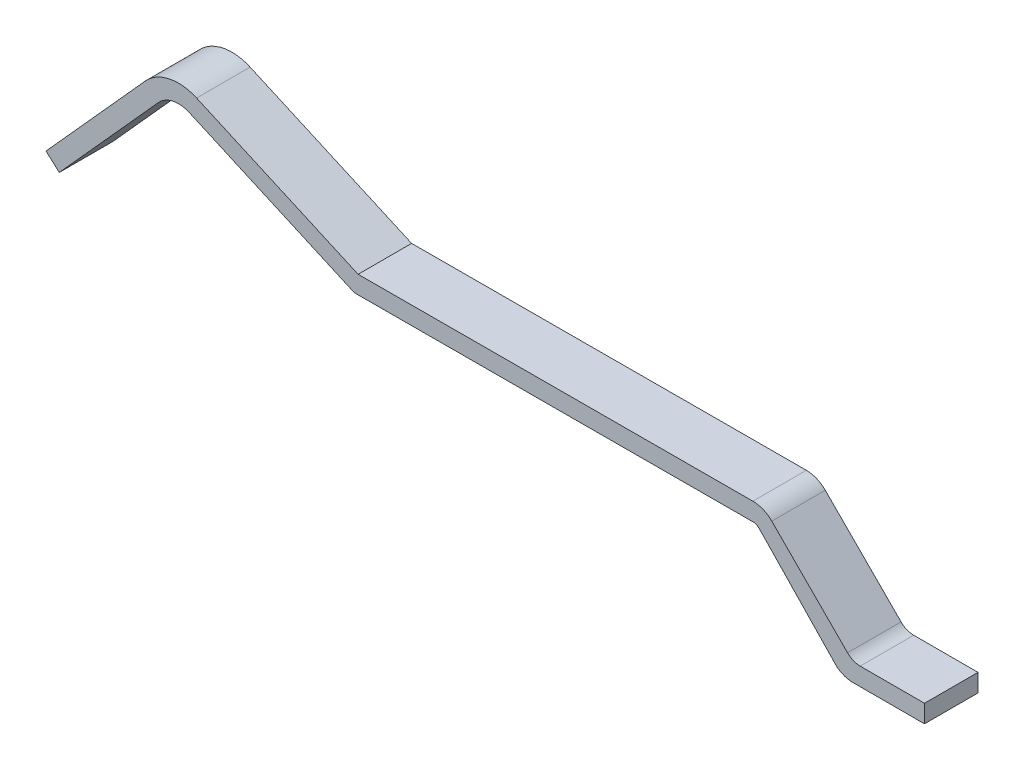
ISO-10303-21;
HEADER;
FILE_DESCRIPTION(('STEP AP214'),'2;1');
FILE_NAME('part.step','',(''),(''),'','','');
FILE_SCHEMA(('AUTOMOTIVE_DESIGN { 1 0 10303 214 1 1 1 1 }'));
ENDSEC;
DATA;
#1=APPLICATION_CONTEXT('core data for automotive mechanical design processes');
#2=APPLICATION_PROTOCOL_DEFINITION('international standard','automotive_design',2000,#1);
#3=PRODUCT_CONTEXT('',#1,'mechanical');
#4=PRODUCT('Part','Part','',(#3));
#5=PRODUCT_RELATED_PRODUCT_CATEGORY('part','',(#4));
#6=PRODUCT_DEFINITION_FORMATION('','',#4);
#7=PRODUCT_DEFINITION_CONTEXT('part definition',#1,'design');
#8=PRODUCT_DEFINITION('design','',#6,#7);
#9=PRODUCT_DEFINITION_SHAPE('','',#8);
#10=(LENGTH_UNIT() NAMED_UNIT(*) SI_UNIT(.MILLI.,.METRE.));
#11=(NAMED_UNIT(*) PLANE_ANGLE_UNIT() SI_UNIT($,.RADIAN.));
#12=(NAMED_UNIT(*) SI_UNIT($,.STERADIAN.) SOLID_ANGLE_UNIT());
#13=UNCERTAINTY_MEASURE_WITH_UNIT(LENGTH_MEASURE(1.E-05),#10,'distance_accuracy_value','');
#14=(GEOMETRIC_REPRESENTATION_CONTEXT(3) GLOBAL_UNCERTAINTY_ASSIGNED_CONTEXT((#13)) GLOBAL_UNIT_ASSIGNED_CONTEXT((#10,
#11,#12)) REPRESENTATION_CONTEXT('',''));
#15=CARTESIAN_POINT('',(0.,0.,0.));
#16=DIRECTION('',(0.,0.,1.));
#17=DIRECTION('',(1.,0.,0.));
#18=AXIS2_PLACEMENT_3D('',#15,#16,#17);
#19=CARTESIAN_POINT('',(18.078994901728,0.200000000000047,0.3));
#20=DIRECTION('',(0.,-1.,0.));
#21=DIRECTION('',(1.,0.,0.));
#22=AXIS2_PLACEMENT_3D('',#19,#20,#21);
#23=PLANE('',#22);
#24=DIRECTION('',(-1.,0.,0.));
#25=VECTOR('',#24,1.);
#26=CARTESIAN_POINT('',(18.078994901728,0.200000000000047,-0.3));
#27=LINE('',#26,#25);
#28=CARTESIAN_POINT('',(18.8,0.200000000000047,-0.3));
#29=VERTEX_POINT('',#28);
#30=CARTESIAN_POINT('',(18.078994901728,0.200000000000047,-0.3));
#31=VERTEX_POINT('',#30);
#32=EDGE_CURVE('E188',#29,#31,#27,.T.);
#33=ORIENTED_EDGE('',*,*,#32,.T.);
#34=DIRECTION('',(0.,0.,-1.));
#35=VECTOR('',#34,1.);
#36=CARTESIAN_POINT('',(18.078994901728,0.200000000000047,0.3));
#37=LINE('',#36,#35);
#38=CARTESIAN_POINT('',(18.078994901728,0.200000000000047,0.3));
#39=VERTEX_POINT('',#38);
#40=EDGE_CURVE('E11',#39,#31,#37,.T.);
#41=ORIENTED_EDGE('',*,*,#40,.F.);
#42=DIRECTION('',(-1.,0.,0.));
#43=VECTOR('',#42,1.);
#44=CARTESIAN_POINT('',(18.078994901728,0.200000000000047,0.3));
#45=LINE('',#44,#43);
#46=CARTESIAN_POINT('',(18.8,0.200000000000047,0.3));
#47=VERTEX_POINT('',#46);
#48=EDGE_CURVE('E222',#47,#39,#45,.T.);
#49=ORIENTED_EDGE('',*,*,#48,.F.);
#50=DIRECTION('',(0.,0.,-1.));
#51=VECTOR('',#50,1.);
#52=CARTESIAN_POINT('',(18.8,0.200000000000047,0.3));
#53=LINE('',#52,#51);
#54=EDGE_CURVE('E184',#47,#29,#53,.T.);
#55=ORIENTED_EDGE('',*,*,#54,.T.);
#56=EDGE_LOOP('',(#33,#41,#49,#55));
#57=FACE_BOUND('',#56,.T.);
#58=ADVANCED_FACE('F32',(#57),#23,.F.);
#59=CARTESIAN_POINT('',(18.078994901728,0.400000000000047,0.3));
#60=DIRECTION('',(0.,0.,-1.));
#61=DIRECTION('',(-1.,0.,0.));
#62=AXIS2_PLACEMENT_3D('',#59,#60,#61);
#63=CYLINDRICAL_SURFACE('',#62,0.2);
#64=CARTESIAN_POINT('',(18.078994901728,0.400000000000047,-0.3));
#65=DIRECTION('',(0.,0.,-1.));
#66=DIRECTION('',(1.,0.,0.));
#67=AXIS2_PLACEMENT_3D('',#64,#65,#66);
#68=CIRCLE('',#67,0.2);
#69=CARTESIAN_POINT('',(17.9372543641692,0.258898547092701,-0.3));
#70=VERTEX_POINT('',#69);
#71=EDGE_CURVE('E191',#31,#70,#68,.T.);
#72=ORIENTED_EDGE('',*,*,#71,.T.);
#73=DIRECTION('',(0.,0.,-1.));
#74=VECTOR('',#73,1.);
#75=CARTESIAN_POINT('',(17.9372543641692,0.258898547092701,0.3));
#76=LINE('',#75,#74);
#77=CARTESIAN_POINT('',(17.9372543641692,0.258898547092701,0.3));
#78=VERTEX_POINT('',#77);
#79=EDGE_CURVE('E40',#78,#70,#76,.T.);
#80=ORIENTED_EDGE('',*,*,#79,.F.);
#81=CARTESIAN_POINT('',(18.078994901728,0.400000000000047,0.3));
#82=DIRECTION('',(0.,0.,-1.));
#83=DIRECTION('',(1.,0.,0.));
#84=AXIS2_PLACEMENT_3D('',#81,#82,#83);
#85=CIRCLE('',#84,0.2);
#86=EDGE_CURVE('E121',#39,#78,#85,.T.);
#87=ORIENTED_EDGE('',*,*,#86,.F.);
#88=ORIENTED_EDGE('',*,*,#40,.T.);
#89=EDGE_LOOP('',(#72,#80,#87,#88));
#90=FACE_BOUND('',#89,.T.);
#91=ADVANCED_FACE('F330',(#90),#63,.F.);
#92=CARTESIAN_POINT('',(17.0878679656441,1.11213203435578,0.3));
#93=DIRECTION('',(-0.708702687793621,-0.705507264536729,0.));
#94=DIRECTION('',(0.705507264536729,-0.708702687793621,0.));
#95=AXIS2_PLACEMENT_3D('',#92,#93,#94);
#96=PLANE('',#95);
#97=DIRECTION('',(-0.705507264536729,0.708702687793621,0.));
#98=VECTOR('',#97,1.);
#99=CARTESIAN_POINT('',(17.0878679656441,1.11213203435578,-0.3));
#100=LINE('',#99,#98);
#101=CARTESIAN_POINT('',(17.0878679656441,1.11213203435578,-0.3));
#102=VERTEX_POINT('',#101);
#103=EDGE_CURVE('E193',#70,#102,#100,.T.);
#104=ORIENTED_EDGE('',*,*,#103,.T.);
#105=DIRECTION('',(0.,0.,-1.));
#106=VECTOR('',#105,1.);
#107=CARTESIAN_POINT('',(17.0878679656441,1.11213203435578,0.3));
#108=LINE('',#107,#106);
#109=CARTESIAN_POINT('',(17.0878679656441,1.11213203435578,0.3));
#110=VERTEX_POINT('',#109);
#111=EDGE_CURVE('E259',#110,#102,#108,.T.);
#112=ORIENTED_EDGE('',*,*,#111,.F.);
#113=DIRECTION('',(-0.705507264536729,0.708702687793621,0.));
#114=VECTOR('',#113,1.);
#115=CARTESIAN_POINT('',(17.0878679656441,1.11213203435578,0.3));
#116=LINE('',#115,#114);
#117=EDGE_CURVE('E267',#78,#110,#116,.T.);
#118=ORIENTED_EDGE('',*,*,#117,.F.);
#119=ORIENTED_EDGE('',*,*,#79,.T.);
#120=EDGE_LOOP('',(#104,#112,#118,#119));
#121=FACE_BOUND('',#120,.T.);
#122=ADVANCED_FACE('F265',(#121),#96,.F.);
#123=CARTESIAN_POINT('',(16.8764101070644,0.901627604302296,0.3));
#124=DIRECTION('',(0.,0.,-1.));
#125=DIRECTION('',(-1.,0.,0.));
#126=AXIS2_PLACEMENT_3D('',#123,#124,#125);
#127=CYLINDRICAL_SURFACE('',#126,0.298373157350417);
#128=CARTESIAN_POINT('',(16.8764101070644,0.901627604302296,-0.3));
#129=DIRECTION('',(0.,0.,1.));
#130=DIRECTION('',(1.,0.,0.));
#131=AXIS2_PLACEMENT_3D('',#128,#129,#130);
#132=CIRCLE('',#131,0.298373157350417);
#133=CARTESIAN_POINT('',(16.8757359312881,1.19999999999982,-0.3));
#134=VERTEX_POINT('',#133);
#135=EDGE_CURVE('E195',#102,#134,#132,.T.);
#136=ORIENTED_EDGE('',*,*,#135,.T.);
#137=DIRECTION('',(0.,0.,-1.));
#138=VECTOR('',#137,1.);
#139=CARTESIAN_POINT('',(16.8757359312881,1.19999999999982,0.3));
#140=LINE('',#139,#138);
#141=CARTESIAN_POINT('',(16.8757359312881,1.19999999999982,0.3));
#142=VERTEX_POINT('',#141);
#143=EDGE_CURVE('E256',#142,#134,#140,.T.);
#144=ORIENTED_EDGE('',*,*,#143,.F.);
#145=CARTESIAN_POINT('',(16.8764101070644,0.901627604302296,0.3));
#146=DIRECTION('',(0.,0.,1.));
#147=DIRECTION('',(1.,0.,0.));
#148=AXIS2_PLACEMENT_3D('',#145,#146,#147);
#149=CIRCLE('',#148,0.298373157350417);
#150=EDGE_CURVE('E285',#110,#142,#149,.T.);
#151=ORIENTED_EDGE('',*,*,#150,.F.);
#152=ORIENTED_EDGE('',*,*,#111,.T.);
#153=EDGE_LOOP('',(#136,#144,#151,#152));
#154=FACE_BOUND('',#153,.T.);
#155=ADVANCED_FACE('F276',(#154),#127,.T.);
#156=CARTESIAN_POINT('',(12.4499999999999,1.19000000000005,0.3));
#157=DIRECTION('',(0.00225950545359492,-0.999997447314295,0.));
#158=DIRECTION('',(0.999997447314295,0.00225950545359492,0.));
#159=AXIS2_PLACEMENT_3D('',#156,#157,#158);
#160=PLANE('',#159);
#161=DIRECTION('',(-0.999997447314295,-0.00225950545359492,0.));
#162=VECTOR('',#161,1.);
#163=CARTESIAN_POINT('',(12.4499999999999,1.19000000000005,-0.3));
#164=LINE('',#163,#162);
#165=CARTESIAN_POINT('',(12.4499999999999,1.19000000000005,-0.3));
#166=VERTEX_POINT('',#165);
#167=EDGE_CURVE('E197',#134,#166,#164,.T.);
#168=ORIENTED_EDGE('',*,*,#167,.T.);
#169=DIRECTION('',(0.,0.,-1.));
#170=VECTOR('',#169,1.);
#171=CARTESIAN_POINT('',(12.4499999999999,1.19000000000005,0.3));
#172=LINE('',#171,#170);
#173=CARTESIAN_POINT('',(12.4499999999999,1.19000000000005,0.3));
#174=VERTEX_POINT('',#173);
#175=EDGE_CURVE('E253',#174,#166,#172,.T.);
#176=ORIENTED_EDGE('',*,*,#175,.F.);
#177=DIRECTION('',(-0.999997447314295,-0.00225950545359492,0.));
#178=VECTOR('',#177,1.);
#179=CARTESIAN_POINT('',(12.4499999999999,1.19000000000005,0.3));
#180=LINE('',#179,#178);
#181=EDGE_CURVE('E282',#142,#174,#180,.T.);
#182=ORIENTED_EDGE('',*,*,#181,.F.);
#183=ORIENTED_EDGE('',*,*,#143,.T.);
#184=EDGE_LOOP('',(#168,#176,#182,#183));
#185=FACE_BOUND('',#184,.T.);
#186=ADVANCED_FACE('F280',(#185),#160,.F.);
#187=CARTESIAN_POINT('',(10.6393188810586,1.9961671740989,0.3));
#188=DIRECTION('',(-0.40673664307565,-0.913545457642668,0.));
#189=DIRECTION('',(0.913545457642668,-0.40673664307565,0.));
#190=AXIS2_PLACEMENT_3D('',#187,#188,#189);
#191=PLANE('',#190);
#192=DIRECTION('',(-0.913545457642668,0.40673664307565,0.));
#193=VECTOR('',#192,1.);
#194=CARTESIAN_POINT('',(10.6393188810586,1.9961671740989,-0.3));
#195=LINE('',#194,#193);
#196=CARTESIAN_POINT('',(10.6393188810586,1.9961671740989,-0.3));
#197=VERTEX_POINT('',#196);
#198=EDGE_CURVE('E199',#166,#197,#195,.T.);
#199=ORIENTED_EDGE('',*,*,#198,.T.);
#200=DIRECTION('',(0.,0.,-1.));
#201=VECTOR('',#200,1.);
#202=CARTESIAN_POINT('',(10.6393188810586,1.9961671740989,0.3));
#203=LINE('',#202,#201);
#204=CARTESIAN_POINT('',(10.6393188810586,1.9961671740989,0.3));
#205=VERTEX_POINT('',#204);
#206=EDGE_CURVE('E250',#205,#197,#203,.T.);
#207=ORIENTED_EDGE('',*,*,#206,.F.);
#208=DIRECTION('',(-0.913545457642668,0.40673664307565,0.));
#209=VECTOR('',#208,1.);
#210=CARTESIAN_POINT('',(10.6393188810586,1.9961671740989,0.3));
#211=LINE('',#210,#209);
#212=EDGE_CURVE('E284',#174,#205,#211,.T.);
#213=ORIENTED_EDGE('',*,*,#212,.F.);
#214=ORIENTED_EDGE('',*,*,#175,.T.);
#215=EDGE_LOOP('',(#199,#207,#213,#214));
#216=FACE_BOUND('',#215,.T.);
#217=ADVANCED_FACE('F343',(#216),#191,.F.);
#218=CARTESIAN_POINT('',(10.4359505595208,1.53939444527736,0.3));
#219=DIRECTION('',(0.,0.,-1.));
#220=DIRECTION('',(-1.,0.,0.));
#221=AXIS2_PLACEMENT_3D('',#218,#219,#220);
#222=CYLINDRICAL_SURFACE('',#221,0.50000000000019);
#223=CARTESIAN_POINT('',(10.4359505595208,1.53939444527736,-0.3));
#224=DIRECTION('',(0.,0.,1.));
#225=DIRECTION('',(1.,0.,0.));
#226=AXIS2_PLACEMENT_3D('',#223,#224,#225);
#227=CIRCLE('',#226,0.50000000000019);
#228=CARTESIAN_POINT('',(10.0643781467819,1.87395974845692,-0.3));
#229=VERTEX_POINT('',#228);
#230=EDGE_CURVE('E201',#197,#229,#227,.T.);
#231=ORIENTED_EDGE('',*,*,#230,.T.);
#232=DIRECTION('',(0.,0.,-1.));
#233=VECTOR('',#232,1.);
#234=CARTESIAN_POINT('',(10.0643781467819,1.87395974845692,0.3));
#235=LINE('',#234,#233);
#236=CARTESIAN_POINT('',(10.0643781467819,1.87395974845692,0.3));
#237=VERTEX_POINT('',#236);
#238=EDGE_CURVE('E247',#237,#229,#235,.T.);
#239=ORIENTED_EDGE('',*,*,#238,.F.);
#240=CARTESIAN_POINT('',(10.4359505595208,1.53939444527736,0.3));
#241=DIRECTION('',(0.,0.,1.));
#242=DIRECTION('',(1.,0.,0.));
#243=AXIS2_PLACEMENT_3D('',#240,#241,#242);
#244=CIRCLE('',#243,0.50000000000019);
#245=EDGE_CURVE('E287',#205,#237,#244,.T.);
#246=ORIENTED_EDGE('',*,*,#245,.F.);
#247=ORIENTED_EDGE('',*,*,#206,.T.);
#248=EDGE_LOOP('',(#231,#239,#246,#247));
#249=FACE_BOUND('',#248,.T.);
#250=ADVANCED_FACE('F346',(#249),#222,.T.);
#251=CARTESIAN_POINT('',(8.95090286046869,0.63732016052452,0.3));
#252=DIRECTION('',(0.743144825477361,-0.669130606358895,0.));
#253=DIRECTION('',(0.669130606358895,0.743144825477361,0.));
#254=AXIS2_PLACEMENT_3D('',#251,#252,#253);
#255=PLANE('',#254);
#256=DIRECTION('',(-0.669130606358895,-0.743144825477361,0.));
#257=VECTOR('',#256,1.);
#258=CARTESIAN_POINT('',(8.95090286046869,0.63732016052452,-0.3));
#259=LINE('',#258,#257);
#260=CARTESIAN_POINT('',(8.95090286046869,0.63732016052452,-0.3));
#261=VERTEX_POINT('',#260);
#262=EDGE_CURVE('E203',#229,#261,#259,.T.);
#263=ORIENTED_EDGE('',*,*,#262,.T.);
#264=DIRECTION('',(0.,0.,-1.));
#265=VECTOR('',#264,1.);
#266=CARTESIAN_POINT('',(8.95090286046869,0.63732016052452,0.3));
#267=LINE('',#266,#265);
#268=CARTESIAN_POINT('',(8.95090286046869,0.63732016052452,0.3));
#269=VERTEX_POINT('',#268);
#270=EDGE_CURVE('E244',#269,#261,#267,.T.);
#271=ORIENTED_EDGE('',*,*,#270,.F.);
#272=DIRECTION('',(-0.669130606358895,-0.743144825477361,0.));
#273=VECTOR('',#272,1.);
#274=CARTESIAN_POINT('',(8.95090286046869,0.63732016052452,0.3));
#275=LINE('',#274,#273);
#276=EDGE_CURVE('E293',#237,#269,#275,.T.);
#277=ORIENTED_EDGE('',*,*,#276,.F.);
#278=ORIENTED_EDGE('',*,*,#238,.T.);
#279=EDGE_LOOP('',(#263,#271,#277,#278));
#280=FACE_BOUND('',#279,.T.);
#281=ADVANCED_FACE('F350',(#280),#255,.F.);
#282=CARTESIAN_POINT('',(9.09953182556442,0.503494039252559,0.3));
#283=DIRECTION('',(0.669130606358746,0.743144825477495,0.));
#284=DIRECTION('',(-0.743144825477495,0.669130606358746,0.));
#285=AXIS2_PLACEMENT_3D('',#282,#283,#284);
#286=PLANE('',#285);
#287=DIRECTION('',(0.743144825477495,-0.669130606358746,0.));
#288=VECTOR('',#287,1.);
#289=CARTESIAN_POINT('',(9.09953182556442,0.503494039252559,-0.3));
#290=LINE('',#289,#288);
#291=CARTESIAN_POINT('',(9.09953182556442,0.503494039252559,-0.3));
#292=VERTEX_POINT('',#291);
#293=EDGE_CURVE('E205',#261,#292,#290,.T.);
#294=ORIENTED_EDGE('',*,*,#293,.T.);
#295=DIRECTION('',(0.,0.,-1.));
#296=VECTOR('',#295,1.);
#297=CARTESIAN_POINT('',(9.09953182556442,0.503494039252559,0.3));
#298=LINE('',#297,#296);
#299=CARTESIAN_POINT('',(9.09953182556442,0.503494039252559,0.3));
#300=VERTEX_POINT('',#299);
#301=EDGE_CURVE('E241',#300,#292,#298,.T.);
#302=ORIENTED_EDGE('',*,*,#301,.F.);
#303=DIRECTION('',(0.743144825477495,-0.669130606358746,0.));
#304=VECTOR('',#303,1.);
#305=CARTESIAN_POINT('',(9.09953182556442,0.503494039252559,0.3));
#306=LINE('',#305,#304);
#307=EDGE_CURVE('E295',#269,#300,#306,.T.);
#308=ORIENTED_EDGE('',*,*,#307,.F.);
#309=ORIENTED_EDGE('',*,*,#270,.T.);
#310=EDGE_LOOP('',(#294,#302,#308,#309));
#311=FACE_BOUND('',#310,.T.);
#312=ADVANCED_FACE('F354',(#311),#286,.F.);
#313=CARTESIAN_POINT('',(10.2130071118774,1.74013362718514,0.3));
#314=DIRECTION('',(-0.743144825477495,0.669130606358746,0.));
#315=DIRECTION('',(-0.669130606358746,-0.743144825477495,0.));
#316=AXIS2_PLACEMENT_3D('',#313,#314,#315);
#317=PLANE('',#316);
#318=DIRECTION('',(0.669130606358746,0.743144825477495,0.));
#319=VECTOR('',#318,1.);
#320=CARTESIAN_POINT('',(10.2130071118774,1.74013362718514,-0.3));
#321=LINE('',#320,#319);
#322=CARTESIAN_POINT('',(10.2130071118774,1.74013362718514,-0.3));
#323=VERTEX_POINT('',#322);
#324=EDGE_CURVE('E207',#292,#323,#321,.T.);
#325=ORIENTED_EDGE('',*,*,#324,.T.);
#326=DIRECTION('',(0.,0.,-1.));
#327=VECTOR('',#326,1.);
#328=CARTESIAN_POINT('',(10.2130071118774,1.74013362718514,0.3));
#329=LINE('',#328,#327);
#330=CARTESIAN_POINT('',(10.2130071118774,1.74013362718514,0.3));
#331=VERTEX_POINT('',#330);
#332=EDGE_CURVE('E238',#331,#323,#329,.T.);
#333=ORIENTED_EDGE('',*,*,#332,.F.);
#334=DIRECTION('',(0.669130606358746,0.743144825477495,0.));
#335=VECTOR('',#334,1.);
#336=CARTESIAN_POINT('',(10.2130071118774,1.74013362718514,0.3));
#337=LINE('',#336,#335);
#338=EDGE_CURVE('E297',#300,#331,#337,.T.);
#339=ORIENTED_EDGE('',*,*,#338,.F.);
#340=ORIENTED_EDGE('',*,*,#301,.T.);
#341=EDGE_LOOP('',(#325,#333,#339,#340));
#342=FACE_BOUND('',#341,.T.);
#343=ADVANCED_FACE('F358',(#342),#317,.F.);
#344=CARTESIAN_POINT('',(10.4359505595208,1.53939444527741,0.3));
#345=DIRECTION('',(0.,0.,-1.));
#346=DIRECTION('',(-1.,0.,0.));
#347=AXIS2_PLACEMENT_3D('',#344,#345,#346);
#348=CYLINDRICAL_SURFACE('',#347,0.300000000000162);
#349=CARTESIAN_POINT('',(10.4359505595208,1.53939444527741,-0.3));
#350=DIRECTION('',(0.,0.,-1.));
#351=DIRECTION('',(1.,0.,0.));
#352=AXIS2_PLACEMENT_3D('',#349,#350,#351);
#353=CIRCLE('',#352,0.300000000000162);
#354=CARTESIAN_POINT('',(10.5579715524435,1.81345808257036,-0.3));
#355=VERTEX_POINT('',#354);
#356=EDGE_CURVE('E209',#323,#355,#353,.T.);
#357=ORIENTED_EDGE('',*,*,#356,.T.);
#358=DIRECTION('',(0.,0.,-1.));
#359=VECTOR('',#358,1.);
#360=CARTESIAN_POINT('',(10.5579715524435,1.81345808257036,0.3));
#361=LINE('',#360,#359);
#362=CARTESIAN_POINT('',(10.5579715524435,1.81345808257036,0.3));
#363=VERTEX_POINT('',#362);
#364=EDGE_CURVE('E235',#363,#355,#361,.T.);
#365=ORIENTED_EDGE('',*,*,#364,.F.);
#366=CARTESIAN_POINT('',(10.4359505595208,1.53939444527741,0.3));
#367=DIRECTION('',(0.,0.,-1.));
#368=DIRECTION('',(1.,0.,0.));
#369=AXIS2_PLACEMENT_3D('',#366,#367,#368);
#370=CIRCLE('',#369,0.300000000000162);
#371=EDGE_CURVE('E299',#331,#363,#370,.T.);
#372=ORIENTED_EDGE('',*,*,#371,.F.);
#373=ORIENTED_EDGE('',*,*,#332,.T.);
#374=EDGE_LOOP('',(#357,#365,#372,#373));
#375=FACE_BOUND('',#374,.T.);
#376=ADVANCED_FACE('F362',(#375),#348,.F.);
#377=CARTESIAN_POINT('',(12.407488687666,0.99,0.3));
#378=DIRECTION('',(0.40673664307565,0.913545457642667,0.));
#379=DIRECTION('',(-0.913545457642668,0.40673664307565,0.));
#380=AXIS2_PLACEMENT_3D('',#377,#378,#379);
#381=PLANE('',#380);
#382=DIRECTION('',(0.913545457642668,-0.40673664307565,0.));
#383=VECTOR('',#382,1.);
#384=CARTESIAN_POINT('',(12.407488687666,0.99,-0.3));
#385=LINE('',#384,#383);
#386=CARTESIAN_POINT('',(12.407488687666,0.99,-0.3));
#387=VERTEX_POINT('',#386);
#388=EDGE_CURVE('E211',#355,#387,#385,.T.);
#389=ORIENTED_EDGE('',*,*,#388,.T.);
#390=DIRECTION('',(0.,0.,-1.));
#391=VECTOR('',#390,1.);
#392=CARTESIAN_POINT('',(12.407488687666,0.99,0.3));
#393=LINE('',#392,#391);
#394=CARTESIAN_POINT('',(12.407488687666,0.99,0.3));
#395=VERTEX_POINT('',#394);
#396=EDGE_CURVE('E232',#395,#387,#393,.T.);
#397=ORIENTED_EDGE('',*,*,#396,.F.);
#398=DIRECTION('',(0.913545457642668,-0.40673664307565,0.));
#399=VECTOR('',#398,1.);
#400=CARTESIAN_POINT('',(12.407488687666,0.99,0.3));
#401=LINE('',#400,#399);
#402=EDGE_CURVE('E301',#363,#395,#401,.T.);
#403=ORIENTED_EDGE('',*,*,#402,.F.);
#404=ORIENTED_EDGE('',*,*,#364,.T.);
#405=EDGE_LOOP('',(#389,#397,#403,#404));
#406=FACE_BOUND('',#405,.T.);
#407=ADVANCED_FACE('F366',(#406),#381,.F.);
#408=CARTESIAN_POINT('',(16.8757359312874,1.00000000000006,0.3));
#409=DIRECTION('',(-0.00223800842061619,0.999997495656019,0.));
#410=DIRECTION('',(-0.999997495656019,-0.00223800842061619,0.));
#411=AXIS2_PLACEMENT_3D('',#408,#409,#410);
#412=PLANE('',#411);
#413=DIRECTION('',(0.999997495656019,0.00223800842061619,0.));
#414=VECTOR('',#413,1.);
#415=CARTESIAN_POINT('',(16.8757359312874,1.00000000000006,-0.3));
#416=LINE('',#415,#414);
#417=CARTESIAN_POINT('',(16.8757359312874,1.00000000000004,-0.3));
#418=VERTEX_POINT('',#417);
#419=EDGE_CURVE('E213',#387,#418,#416,.T.);
#420=ORIENTED_EDGE('',*,*,#419,.T.);
#421=DIRECTION('',(0.,0.,-1.));
#422=VECTOR('',#421,1.);
#423=CARTESIAN_POINT('',(16.8757359312874,1.00000000000004,0.3));
#424=LINE('',#423,#422);
#425=CARTESIAN_POINT('',(16.8757359312874,1.00000000000004,0.3));
#426=VERTEX_POINT('',#425);
#427=EDGE_CURVE('E229',#426,#418,#424,.T.);
#428=ORIENTED_EDGE('',*,*,#427,.F.);
#429=DIRECTION('',(0.999997495656019,0.00223800842061619,0.));
#430=VECTOR('',#429,1.);
#431=CARTESIAN_POINT('',(16.8757359312874,1.00000000000006,0.3));
#432=LINE('',#431,#430);
#433=EDGE_CURVE('E303',#395,#426,#432,.T.);
#434=ORIENTED_EDGE('',*,*,#433,.F.);
#435=ORIENTED_EDGE('',*,*,#396,.T.);
#436=EDGE_LOOP('',(#420,#428,#434,#435));
#437=FACE_BOUND('',#436,.T.);
#438=ADVANCED_FACE('F370',(#437),#412,.F.);
#439=CARTESIAN_POINT('',(16.8759585299795,0.900537400779785,0.3));
#440=DIRECTION('',(0.,0.,-1.));
#441=DIRECTION('',(-1.,0.,0.));
#442=AXIS2_PLACEMENT_3D('',#439,#440,#441);
#443=CYLINDRICAL_SURFACE('',#442,0.0994628483094401);
#444=CARTESIAN_POINT('',(16.8759585299795,0.900537400779785,-0.3));
#445=DIRECTION('',(0.,0.,-1.));
#446=DIRECTION('',(-1.,0.,0.));
#447=AXIS2_PLACEMENT_3D('',#444,#445,#446);
#448=CIRCLE('',#447,0.0994628483094401);
#449=CARTESIAN_POINT('',(16.9464466094068,0.970710678118623,-0.3));
#450=VERTEX_POINT('',#449);
#451=EDGE_CURVE('E215',#418,#450,#448,.T.);
#452=ORIENTED_EDGE('',*,*,#451,.T.);
#453=DIRECTION('',(0.,0.,-1.));
#454=VECTOR('',#453,1.);
#455=CARTESIAN_POINT('',(16.9464466094068,0.970710678118623,0.3));
#456=LINE('',#455,#454);
#457=CARTESIAN_POINT('',(16.9464466094068,0.970710678118623,0.3));
#458=VERTEX_POINT('',#457);
#459=EDGE_CURVE('E226',#458,#450,#456,.T.);
#460=ORIENTED_EDGE('',*,*,#459,.F.);
#461=CARTESIAN_POINT('',(16.8759585299795,0.900537400779785,0.3));
#462=DIRECTION('',(0.,0.,-1.));
#463=DIRECTION('',(-1.,0.,0.));
#464=AXIS2_PLACEMENT_3D('',#461,#462,#463);
#465=CIRCLE('',#464,0.0994628483094401);
#466=EDGE_CURVE('E305',#426,#458,#465,.T.);
#467=ORIENTED_EDGE('',*,*,#466,.F.);
#468=ORIENTED_EDGE('',*,*,#427,.T.);
#469=EDGE_LOOP('',(#452,#460,#467,#468));
#470=FACE_BOUND('',#469,.T.);
#471=ADVANCED_FACE('F311',(#470),#443,.F.);
#472=CARTESIAN_POINT('',(17.82,0.0599999999999465,0.3));
#473=DIRECTION('',(0.721675803920417,0.692231199842813,0.));
#474=DIRECTION('',(-0.692231199842813,0.721675803920417,0.));
#475=AXIS2_PLACEMENT_3D('',#472,#473,#474);
#476=PLANE('',#475);
#477=DIRECTION('',(0.692231199842813,-0.721675803920417,0.));
#478=VECTOR('',#477,1.);
#479=CARTESIAN_POINT('',(17.82,0.0599999999999465,-0.3));
#480=LINE('',#479,#478);
#481=CARTESIAN_POINT('',(17.82,0.0599999999999465,-0.3));
#482=VERTEX_POINT('',#481);
#483=EDGE_CURVE('E217',#450,#482,#480,.T.);
#484=ORIENTED_EDGE('',*,*,#483,.T.);
#485=DIRECTION('',(0.,0.,-1.));
#486=VECTOR('',#485,1.);
#487=CARTESIAN_POINT('',(17.82,0.0599999999999465,0.3));
#488=LINE('',#487,#486);
#489=CARTESIAN_POINT('',(17.82,0.0599999999999465,0.3));
#490=VERTEX_POINT('',#489);
#491=EDGE_CURVE('E179',#490,#482,#488,.T.);
#492=ORIENTED_EDGE('',*,*,#491,.F.);
#493=DIRECTION('',(0.692231199842813,-0.721675803920417,0.));
#494=VECTOR('',#493,1.);
#495=CARTESIAN_POINT('',(17.82,0.0599999999999465,0.3));
#496=LINE('',#495,#494);
#497=EDGE_CURVE('E170',#458,#490,#496,.T.);
#498=ORIENTED_EDGE('',*,*,#497,.F.);
#499=ORIENTED_EDGE('',*,*,#459,.T.);
#500=EDGE_LOOP('',(#484,#492,#498,#499));
#501=FACE_BOUND('',#500,.T.);
#502=ADVANCED_FACE('F315',(#501),#476,.F.);
#503=CARTESIAN_POINT('',(18.,0.300000000000376,0.3));
#504=DIRECTION('',(0.,0.,-1.));
#505=DIRECTION('',(-1.,0.,0.));
#506=AXIS2_PLACEMENT_3D('',#503,#504,#505);
#507=CYLINDRICAL_SURFACE('',#506,0.300000000000358);
#508=CARTESIAN_POINT('',(18.,0.300000000000376,-0.3));
#509=DIRECTION('',(0.,0.,1.));
#510=DIRECTION('',(-1.,0.,0.));
#511=AXIS2_PLACEMENT_3D('',#508,#509,#510);
#512=CIRCLE('',#511,0.300000000000358);
#513=CARTESIAN_POINT('',(18.,0.,-0.3));
#514=VERTEX_POINT('',#513);
#515=EDGE_CURVE('E178',#482,#514,#512,.T.);
#516=ORIENTED_EDGE('',*,*,#515,.T.);
#517=DIRECTION('',(0.,0.,-1.));
#518=VECTOR('',#517,1.);
#519=CARTESIAN_POINT('',(18.,0.,0.3));
#520=LINE('',#519,#518);
#521=CARTESIAN_POINT('',(18.,0.,0.3));
#522=VERTEX_POINT('',#521);
#523=EDGE_CURVE('E175',#522,#514,#520,.T.);
#524=ORIENTED_EDGE('',*,*,#523,.F.);
#525=CARTESIAN_POINT('',(18.,0.300000000000376,0.3));
#526=DIRECTION('',(0.,0.,1.));
#527=DIRECTION('',(-1.,0.,0.));
#528=AXIS2_PLACEMENT_3D('',#525,#526,#527);
#529=CIRCLE('',#528,0.300000000000358);
#530=EDGE_CURVE('E164',#490,#522,#529,.T.);
#531=ORIENTED_EDGE('',*,*,#530,.F.);
#532=ORIENTED_EDGE('',*,*,#491,.T.);
#533=EDGE_LOOP('',(#516,#524,#531,#532));
#534=FACE_BOUND('',#533,.T.);
#535=ADVANCED_FACE('F176',(#534),#507,.T.);
#536=CARTESIAN_POINT('',(18.8,0.,0.3));
#537=DIRECTION('',(0.,1.,0.));
#538=DIRECTION('',(-1.,0.,0.));
#539=AXIS2_PLACEMENT_3D('',#536,#537,#538);
#540=PLANE('',#539);
#541=DIRECTION('',(1.,0.,0.));
#542=VECTOR('',#541,1.);
#543=CARTESIAN_POINT('',(18.8,0.,-0.3));
#544=LINE('',#543,#542);
#545=CARTESIAN_POINT('',(18.8,0.,-0.3));
#546=VERTEX_POINT('',#545);
#547=EDGE_CURVE('E107',#514,#546,#544,.T.);
#548=ORIENTED_EDGE('',*,*,#547,.T.);
#549=DIRECTION('',(0.,0.,-1.));
#550=VECTOR('',#549,1.);
#551=CARTESIAN_POINT('',(18.8,0.,0.3));
#552=LINE('',#551,#550);
#553=CARTESIAN_POINT('',(18.8,0.,0.3));
#554=VERTEX_POINT('',#553);
#555=EDGE_CURVE('E180',#554,#546,#552,.T.);
#556=ORIENTED_EDGE('',*,*,#555,.F.);
#557=DIRECTION('',(1.,0.,0.));
#558=VECTOR('',#557,1.);
#559=CARTESIAN_POINT('',(18.8,0.,0.3));
#560=LINE('',#559,#558);
#561=EDGE_CURVE('E168',#522,#554,#560,.T.);
#562=ORIENTED_EDGE('',*,*,#561,.F.);
#563=ORIENTED_EDGE('',*,*,#523,.T.);
#564=EDGE_LOOP('',(#548,#556,#562,#563));
#565=FACE_BOUND('',#564,.T.);
#566=ADVANCED_FACE('F182',(#565),#540,.F.);
#567=CARTESIAN_POINT('',(18.8,0.200000000000047,0.3));
#568=DIRECTION('',(-1.,0.,0.));
#569=DIRECTION('',(0.,0.,1.));
#570=AXIS2_PLACEMENT_3D('',#567,#568,#569);
#571=PLANE('',#570);
#572=DIRECTION('',(0.,1.,0.));
#573=VECTOR('',#572,1.);
#574=CARTESIAN_POINT('',(18.8,0.200000000000047,-0.3));
#575=LINE('',#574,#573);
#576=EDGE_CURVE('E113',#546,#29,#575,.T.);
#577=ORIENTED_EDGE('',*,*,#576,.T.);
#578=ORIENTED_EDGE('',*,*,#54,.F.);
#579=DIRECTION('',(0.,1.,0.));
#580=VECTOR('',#579,1.);
#581=CARTESIAN_POINT('',(18.8,0.200000000000047,0.3));
#582=LINE('',#581,#580);
#583=EDGE_CURVE('E48',#554,#47,#582,.T.);
#584=ORIENTED_EDGE('',*,*,#583,.F.);
#585=ORIENTED_EDGE('',*,*,#555,.T.);
#586=EDGE_LOOP('',(#577,#578,#584,#585));
#587=FACE_BOUND('',#586,.T.);
#588=ADVANCED_FACE('F319',(#587),#571,.F.);
#589=CARTESIAN_POINT('',(18.,0.300000000000376,0.3));
#590=DIRECTION('',(0.,0.,-1.));
#591=DIRECTION('',(-1.,0.,0.));
#592=AXIS2_PLACEMENT_3D('',#589,#590,#591);
#593=PLANE('',#592);
#594=ORIENTED_EDGE('',*,*,#48,.T.);
#595=ORIENTED_EDGE('',*,*,#86,.T.);
#596=ORIENTED_EDGE('',*,*,#117,.T.);
#597=ORIENTED_EDGE('',*,*,#150,.T.);
#598=ORIENTED_EDGE('',*,*,#181,.T.);
#599=ORIENTED_EDGE('',*,*,#212,.T.);
#600=ORIENTED_EDGE('',*,*,#245,.T.);
#601=ORIENTED_EDGE('',*,*,#276,.T.);
#602=ORIENTED_EDGE('',*,*,#307,.T.);
#603=ORIENTED_EDGE('',*,*,#338,.T.);
#604=ORIENTED_EDGE('',*,*,#371,.T.);
#605=ORIENTED_EDGE('',*,*,#402,.T.);
#606=ORIENTED_EDGE('',*,*,#433,.T.);
#607=ORIENTED_EDGE('',*,*,#466,.T.);
#608=ORIENTED_EDGE('',*,*,#497,.T.);
#609=ORIENTED_EDGE('',*,*,#530,.T.);
#610=ORIENTED_EDGE('',*,*,#561,.T.);
#611=ORIENTED_EDGE('',*,*,#583,.T.);
#612=EDGE_LOOP('',(#594,#595,#596,#597,#598,#599,#600,#601,#602,#603,#604,#605,#606,#607,#608,
#609,#610,#611));
#613=FACE_BOUND('',#612,.T.);
#614=ADVANCED_FACE('F166',(#613),#593,.F.);
#615=CARTESIAN_POINT('',(18.,0.300000000000376,-0.3));
#616=DIRECTION('',(0.,0.,-1.));
#617=DIRECTION('',(-1.,0.,0.));
#618=AXIS2_PLACEMENT_3D('',#615,#616,#617);
#619=PLANE('',#618);
#620=ORIENTED_EDGE('',*,*,#32,.F.);
#621=ORIENTED_EDGE('',*,*,#576,.F.);
#622=ORIENTED_EDGE('',*,*,#547,.F.);
#623=ORIENTED_EDGE('',*,*,#515,.F.);
#624=ORIENTED_EDGE('',*,*,#483,.F.);
#625=ORIENTED_EDGE('',*,*,#451,.F.);
#626=ORIENTED_EDGE('',*,*,#419,.F.);
#627=ORIENTED_EDGE('',*,*,#388,.F.);
#628=ORIENTED_EDGE('',*,*,#356,.F.);
#629=ORIENTED_EDGE('',*,*,#324,.F.);
#630=ORIENTED_EDGE('',*,*,#293,.F.);
#631=ORIENTED_EDGE('',*,*,#262,.F.);
#632=ORIENTED_EDGE('',*,*,#230,.F.);
#633=ORIENTED_EDGE('',*,*,#198,.F.);
#634=ORIENTED_EDGE('',*,*,#167,.F.);
#635=ORIENTED_EDGE('',*,*,#135,.F.);
#636=ORIENTED_EDGE('',*,*,#103,.F.);
#637=ORIENTED_EDGE('',*,*,#71,.F.);
#638=EDGE_LOOP('',(#620,#621,#622,#623,#624,#625,#626,#627,#628,#629,#630,#631,#632,#633,#634,
#635,#636,#637));
#639=FACE_BOUND('',#638,.T.);
#640=ADVANCED_FACE('F271',(#639),#619,.T.);
#641=CLOSED_SHELL('',(#58,#91,#122,#155,#186,#217,#250,#281,#312,#343,#376,#407,#438,#471,#502,
#535,#566,#588,#614,#640));
#642=MANIFOLD_SOLID_BREP('B2',#641);
#643=ADVANCED_BREP_SHAPE_REPRESENTATION('',(#18,#642),#14);
#644=SHAPE_DEFINITION_REPRESENTATION(#9,#643);
ENDSEC;
END-ISO-10303-21;
